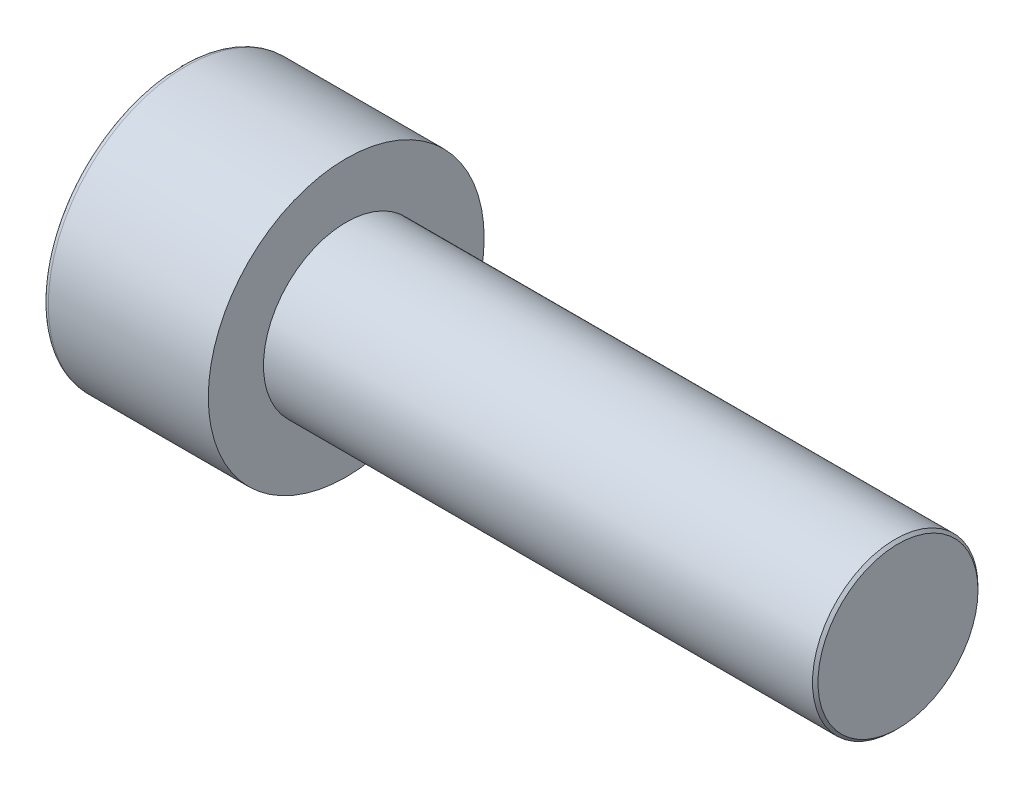
ISO-10303-21;
HEADER;
FILE_DESCRIPTION(('STEP AP214'),'2;1');
FILE_NAME('part.step','',(''),(''),'','','');
FILE_SCHEMA(('AUTOMOTIVE_DESIGN { 1 0 10303 214 1 1 1 1 }'));
ENDSEC;
DATA;
#1=APPLICATION_CONTEXT('core data for automotive mechanical design processes');
#2=APPLICATION_PROTOCOL_DEFINITION('international standard','automotive_design',2000,#1);
#3=PRODUCT_CONTEXT('',#1,'mechanical');
#4=PRODUCT('Part','Part','',(#3));
#5=PRODUCT_RELATED_PRODUCT_CATEGORY('part','',(#4));
#6=PRODUCT_DEFINITION_FORMATION('','',#4);
#7=PRODUCT_DEFINITION_CONTEXT('part definition',#1,'design');
#8=PRODUCT_DEFINITION('design','',#6,#7);
#9=PRODUCT_DEFINITION_SHAPE('','',#8);
#10=(LENGTH_UNIT() NAMED_UNIT(*) SI_UNIT(.MILLI.,.METRE.));
#11=(NAMED_UNIT(*) PLANE_ANGLE_UNIT() SI_UNIT($,.RADIAN.));
#12=(NAMED_UNIT(*) SI_UNIT($,.STERADIAN.) SOLID_ANGLE_UNIT());
#13=UNCERTAINTY_MEASURE_WITH_UNIT(LENGTH_MEASURE(1.E-05),#10,'distance_accuracy_value','');
#14=(GEOMETRIC_REPRESENTATION_CONTEXT(3) GLOBAL_UNCERTAINTY_ASSIGNED_CONTEXT((#13)) GLOBAL_UNIT_ASSIGNED_CONTEXT((#10,
#11,#12)) REPRESENTATION_CONTEXT('',''));
#15=CARTESIAN_POINT('',(0.,0.,0.));
#16=DIRECTION('',(0.,0.,1.));
#17=DIRECTION('',(1.,0.,0.));
#18=AXIS2_PLACEMENT_3D('',#15,#16,#17);
#19=CARTESIAN_POINT('',(3.,0.,-2.88675134594813));
#20=DIRECTION('',(1.,0.,0.));
#21=DIRECTION('',(0.,0.,-1.));
#22=AXIS2_PLACEMENT_3D('',#19,#20,#21);
#23=PLANE('',#22);
#24=CARTESIAN_POINT('',(3.,0.,0.));
#25=DIRECTION('',(1.,0.,0.));
#26=DIRECTION('',(0.,0.,-1.));
#27=AXIS2_PLACEMENT_3D('',#24,#25,#26);
#28=CIRCLE('',#27,2.5);
#29=CARTESIAN_POINT('',(3.,-1.25,-2.1650635094611));
#30=VERTEX_POINT('',#29);
#31=CARTESIAN_POINT('',(3.,-2.5,0.));
#32=VERTEX_POINT('',#31);
#33=EDGE_CURVE('E159',#30,#32,#28,.F.);
#34=ORIENTED_EDGE('',*,*,#33,.F.);
#35=DIRECTION('',(0.,0.866025403784439,-0.5));
#36=VECTOR('',#35,1.);
#37=CARTESIAN_POINT('',(3.,-2.5,-1.44337567297407));
#38=LINE('',#37,#36);
#39=CARTESIAN_POINT('',(3.,-2.5,-1.44337567297407));
#40=VERTEX_POINT('',#39);
#41=EDGE_CURVE('E167',#40,#30,#38,.T.);
#42=ORIENTED_EDGE('',*,*,#41,.F.);
#43=DIRECTION('',(0.,0.,-1.));
#44=VECTOR('',#43,1.);
#45=CARTESIAN_POINT('',(3.,-2.5,1.44337567297406));
#46=LINE('',#45,#44);
#47=EDGE_CURVE('E184',#32,#40,#46,.T.);
#48=ORIENTED_EDGE('',*,*,#47,.F.);
#49=EDGE_LOOP('',(#34,#42,#48));
#50=FACE_BOUND('',#49,.T.);
#51=ADVANCED_FACE('F36',(#50),#23,.F.);
#52=CARTESIAN_POINT('',(3.,-1.25,2.1650635094611));
#53=VERTEX_POINT('',#52);
#54=EDGE_CURVE('E289',#32,#53,#28,.F.);
#55=ORIENTED_EDGE('',*,*,#54,.F.);
#56=CARTESIAN_POINT('',(3.,-2.5,1.44337567297406));
#57=VERTEX_POINT('',#56);
#58=EDGE_CURVE('E185',#57,#32,#46,.T.);
#59=ORIENTED_EDGE('',*,*,#58,.F.);
#60=DIRECTION('',(0.,-0.866025403784439,-0.5));
#61=VECTOR('',#60,1.);
#62=CARTESIAN_POINT('',(3.,0.,2.88675134594813));
#63=LINE('',#62,#61);
#64=EDGE_CURVE('E180',#53,#57,#63,.T.);
#65=ORIENTED_EDGE('',*,*,#64,.F.);
#66=EDGE_LOOP('',(#55,#59,#65));
#67=FACE_BOUND('',#66,.T.);
#68=ADVANCED_FACE('F125',(#67),#23,.F.);
#69=CARTESIAN_POINT('',(3.,1.25,2.1650635094611));
#70=VERTEX_POINT('',#69);
#71=EDGE_CURVE('E285',#53,#70,#28,.F.);
#72=ORIENTED_EDGE('',*,*,#71,.F.);
#73=CARTESIAN_POINT('',(3.,0.,2.88675134594813));
#74=VERTEX_POINT('',#73);
#75=EDGE_CURVE('E181',#74,#53,#63,.T.);
#76=ORIENTED_EDGE('',*,*,#75,.F.);
#77=DIRECTION('',(0.,-0.866025403784439,0.5));
#78=VECTOR('',#77,1.);
#79=CARTESIAN_POINT('',(3.,2.5,1.44337567297406));
#80=LINE('',#79,#78);
#81=EDGE_CURVE('E176',#70,#74,#80,.T.);
#82=ORIENTED_EDGE('',*,*,#81,.F.);
#83=EDGE_LOOP('',(#72,#76,#82));
#84=FACE_BOUND('',#83,.T.);
#85=ADVANCED_FACE('F131',(#84),#23,.F.);
#86=CARTESIAN_POINT('',(3.,2.5,0.));
#87=VERTEX_POINT('',#86);
#88=EDGE_CURVE('E156',#70,#87,#28,.F.);
#89=ORIENTED_EDGE('',*,*,#88,.F.);
#90=CARTESIAN_POINT('',(3.,2.5,1.44337567297406));
#91=VERTEX_POINT('',#90);
#92=EDGE_CURVE('E177',#91,#70,#80,.T.);
#93=ORIENTED_EDGE('',*,*,#92,.F.);
#94=DIRECTION('',(0.,0.,1.));
#95=VECTOR('',#94,1.);
#96=CARTESIAN_POINT('',(3.,2.5,-1.44337567297406));
#97=LINE('',#96,#95);
#98=EDGE_CURVE('E171',#87,#91,#97,.T.);
#99=ORIENTED_EDGE('',*,*,#98,.F.);
#100=EDGE_LOOP('',(#89,#93,#99));
#101=FACE_BOUND('',#100,.T.);
#102=ADVANCED_FACE('F145',(#101),#23,.F.);
#103=CARTESIAN_POINT('',(3.,0.,0.));
#104=DIRECTION('',(1.,0.,0.));
#105=DIRECTION('',(0.,0.,-1.));
#106=AXIS2_PLACEMENT_3D('',#103,#104,#105);
#107=CIRCLE('',#106,2.5);
#108=CARTESIAN_POINT('',(3.,1.25,-2.1650635094611));
#109=VERTEX_POINT('',#108);
#110=EDGE_CURVE('E51',#109,#87,#107,.T.);
#111=ORIENTED_EDGE('',*,*,#110,.T.);
#112=CARTESIAN_POINT('',(3.,2.5,-1.44337567297406));
#113=VERTEX_POINT('',#112);
#114=EDGE_CURVE('E164',#113,#87,#97,.T.);
#115=ORIENTED_EDGE('',*,*,#114,.F.);
#116=DIRECTION('',(0.,0.866025403784438,0.5));
#117=VECTOR('',#116,1.);
#118=CARTESIAN_POINT('',(3.,0.,-2.88675134594813));
#119=LINE('',#118,#117);
#120=EDGE_CURVE('E161',#109,#113,#119,.T.);
#121=ORIENTED_EDGE('',*,*,#120,.F.);
#122=EDGE_LOOP('',(#111,#115,#121));
#123=FACE_BOUND('',#122,.T.);
#124=ADVANCED_FACE('F136',(#123),#23,.F.);
#125=EDGE_CURVE('E149',#109,#30,#28,.F.);
#126=ORIENTED_EDGE('',*,*,#125,.F.);
#127=CARTESIAN_POINT('',(3.,0.,-2.88675134594813));
#128=VERTEX_POINT('',#127);
#129=EDGE_CURVE('E152',#128,#109,#119,.T.);
#130=ORIENTED_EDGE('',*,*,#129,.F.);
#131=EDGE_CURVE('E154',#30,#128,#38,.T.);
#132=ORIENTED_EDGE('',*,*,#131,.F.);
#133=EDGE_LOOP('',(#126,#130,#132));
#134=FACE_BOUND('',#133,.T.);
#135=ADVANCED_FACE('F127',(#134),#23,.F.);
#136=CARTESIAN_POINT('',(0.,0.,0.));
#137=DIRECTION('',(1.,0.,0.));
#138=DIRECTION('',(0.,0.,-1.));
#139=AXIS2_PLACEMENT_3D('',#136,#137,#138);
#140=PLANE('',#139);
#141=CARTESIAN_POINT('',(0.,0.,0.));
#142=DIRECTION('',(1.,0.,0.));
#143=DIRECTION('',(0.,0.,-1.));
#144=AXIS2_PLACEMENT_3D('',#141,#142,#143);
#145=CIRCLE('',#144,4.8);
#146=CARTESIAN_POINT('',(0.,0.,-4.8));
#147=VERTEX_POINT('',#146);
#148=EDGE_CURVE('E224',#147,#147,#145,.F.);
#149=ORIENTED_EDGE('',*,*,#148,.T.);
#150=EDGE_LOOP('',(#149));
#151=FACE_BOUND('',#150,.T.);
#152=DIRECTION('',(0.,0.866025403784439,-0.5));
#153=VECTOR('',#152,1.);
#154=CARTESIAN_POINT('',(0.,-2.5,-1.44337567297407));
#155=LINE('',#154,#153);
#156=CARTESIAN_POINT('',(0.,-2.5,-1.44337567297407));
#157=VERTEX_POINT('',#156);
#158=CARTESIAN_POINT('',(0.,0.,-2.88675134594813));
#159=VERTEX_POINT('',#158);
#160=EDGE_CURVE('E59',#157,#159,#155,.T.);
#161=ORIENTED_EDGE('',*,*,#160,.T.);
#162=DIRECTION('',(0.,0.866025403784438,0.5));
#163=VECTOR('',#162,1.);
#164=CARTESIAN_POINT('',(0.,0.,-2.88675134594813));
#165=LINE('',#164,#163);
#166=CARTESIAN_POINT('',(0.,2.5,-1.44337567297406));
#167=VERTEX_POINT('',#166);
#168=EDGE_CURVE('E190',#159,#167,#165,.T.);
#169=ORIENTED_EDGE('',*,*,#168,.T.);
#170=DIRECTION('',(0.,0.,1.));
#171=VECTOR('',#170,1.);
#172=CARTESIAN_POINT('',(0.,2.5,-1.44337567297406));
#173=LINE('',#172,#171);
#174=CARTESIAN_POINT('',(0.,2.5,1.44337567297406));
#175=VERTEX_POINT('',#174);
#176=EDGE_CURVE('E193',#167,#175,#173,.T.);
#177=ORIENTED_EDGE('',*,*,#176,.T.);
#178=DIRECTION('',(0.,-0.866025403784439,0.5));
#179=VECTOR('',#178,1.);
#180=CARTESIAN_POINT('',(0.,2.5,1.44337567297406));
#181=LINE('',#180,#179);
#182=CARTESIAN_POINT('',(0.,0.,2.88675134594813));
#183=VERTEX_POINT('',#182);
#184=EDGE_CURVE('E196',#175,#183,#181,.T.);
#185=ORIENTED_EDGE('',*,*,#184,.T.);
#186=DIRECTION('',(0.,-0.866025403784439,-0.5));
#187=VECTOR('',#186,1.);
#188=CARTESIAN_POINT('',(0.,0.,2.88675134594813));
#189=LINE('',#188,#187);
#190=CARTESIAN_POINT('',(0.,-2.5,1.44337567297406));
#191=VERTEX_POINT('',#190);
#192=EDGE_CURVE('E199',#183,#191,#189,.T.);
#193=ORIENTED_EDGE('',*,*,#192,.T.);
#194=DIRECTION('',(0.,0.,-1.));
#195=VECTOR('',#194,1.);
#196=CARTESIAN_POINT('',(0.,-2.5,1.44337567297406));
#197=LINE('',#196,#195);
#198=EDGE_CURVE('E202',#191,#157,#197,.T.);
#199=ORIENTED_EDGE('',*,*,#198,.T.);
#200=EDGE_LOOP('',(#161,#169,#177,#185,#193,#199));
#201=FACE_BOUND('',#200,.T.);
#202=ADVANCED_FACE('F135',(#151,#201),#140,.F.);
#203=CARTESIAN_POINT('',(6.,0.,0.));
#204=DIRECTION('',(1.,0.,0.));
#205=DIRECTION('',(0.,0.,-1.));
#206=AXIS2_PLACEMENT_3D('',#203,#204,#205);
#207=PLANE('',#206);
#208=CARTESIAN_POINT('',(6.,0.,0.));
#209=DIRECTION('',(1.,0.,0.));
#210=DIRECTION('',(0.,0.,-1.));
#211=AXIS2_PLACEMENT_3D('',#208,#209,#210);
#212=CIRCLE('',#211,5.);
#213=CARTESIAN_POINT('',(6.,0.,-5.));
#214=VERTEX_POINT('',#213);
#215=EDGE_CURVE('E157',#214,#214,#212,.T.);
#216=ORIENTED_EDGE('',*,*,#215,.T.);
#217=EDGE_LOOP('',(#216));
#218=FACE_BOUND('',#217,.T.);
#219=CARTESIAN_POINT('',(6.,0.,0.));
#220=DIRECTION('',(1.,0.,0.));
#221=DIRECTION('',(0.,0.,-1.));
#222=AXIS2_PLACEMENT_3D('',#219,#220,#221);
#223=CIRCLE('',#222,3.);
#224=CARTESIAN_POINT('',(6.,0.,-3.));
#225=VERTEX_POINT('',#224);
#226=EDGE_CURVE('E215',#225,#225,#223,.T.);
#227=ORIENTED_EDGE('',*,*,#226,.F.);
#228=EDGE_LOOP('',(#227));
#229=FACE_BOUND('',#228,.T.);
#230=ADVANCED_FACE('F142',(#218,#229),#207,.T.);
#231=CARTESIAN_POINT('',(6.,0.,0.));
#232=DIRECTION('',(-1.,0.,0.));
#233=DIRECTION('',(0.,0.,1.));
#234=AXIS2_PLACEMENT_3D('',#231,#232,#233);
#235=CYLINDRICAL_SURFACE('',#234,5.);
#236=CARTESIAN_POINT('',(0.2,0.,0.));
#237=DIRECTION('',(1.,0.,0.));
#238=DIRECTION('',(0.,0.,-1.));
#239=AXIS2_PLACEMENT_3D('',#236,#237,#238);
#240=CIRCLE('',#239,5.);
#241=CARTESIAN_POINT('',(0.2,0.,-5.));
#242=VERTEX_POINT('',#241);
#243=EDGE_CURVE('E221',#242,#242,#240,.T.);
#244=ORIENTED_EDGE('',*,*,#243,.T.);
#245=EDGE_LOOP('',(#244));
#246=FACE_BOUND('',#245,.T.);
#247=ORIENTED_EDGE('',*,*,#215,.F.);
#248=EDGE_LOOP('',(#247));
#249=FACE_BOUND('',#248,.T.);
#250=ADVANCED_FACE('F240',(#246,#249),#235,.T.);
#251=CARTESIAN_POINT('',(26.,0.,0.));
#252=DIRECTION('',(-1.,0.,0.));
#253=DIRECTION('',(0.,0.,1.));
#254=AXIS2_PLACEMENT_3D('',#251,#252,#253);
#255=CYLINDRICAL_SURFACE('',#254,3.);
#256=CARTESIAN_POINT('',(25.9,0.,0.));
#257=DIRECTION('',(1.,0.,0.));
#258=DIRECTION('',(0.,0.,-1.));
#259=AXIS2_PLACEMENT_3D('',#256,#257,#258);
#260=CIRCLE('',#259,3.);
#261=CARTESIAN_POINT('',(25.9,0.,-3.));
#262=VERTEX_POINT('',#261);
#263=EDGE_CURVE('E11',#262,#262,#260,.F.);
#264=ORIENTED_EDGE('',*,*,#263,.T.);
#265=EDGE_LOOP('',(#264));
#266=FACE_BOUND('',#265,.T.);
#267=ORIENTED_EDGE('',*,*,#226,.T.);
#268=EDGE_LOOP('',(#267));
#269=FACE_BOUND('',#268,.T.);
#270=ADVANCED_FACE('F237',(#266,#269),#255,.T.);
#271=CARTESIAN_POINT('',(26.,0.,0.));
#272=DIRECTION('',(1.,0.,0.));
#273=DIRECTION('',(0.,0.,-1.));
#274=AXIS2_PLACEMENT_3D('',#271,#272,#273);
#275=PLANE('',#274);
#276=CARTESIAN_POINT('',(26.,0.,0.));
#277=DIRECTION('',(1.,0.,0.));
#278=DIRECTION('',(0.,0.,-1.));
#279=AXIS2_PLACEMENT_3D('',#276,#277,#278);
#280=CIRCLE('',#279,2.9);
#281=CARTESIAN_POINT('',(26.,0.,-2.9));
#282=VERTEX_POINT('',#281);
#283=EDGE_CURVE('E44',#282,#282,#280,.T.);
#284=ORIENTED_EDGE('',*,*,#283,.T.);
#285=EDGE_LOOP('',(#284));
#286=FACE_BOUND('',#285,.T.);
#287=ADVANCED_FACE('F229',(#286),#275,.T.);
#288=CARTESIAN_POINT('',(3.,-2.5,-1.44337567297407));
#289=DIRECTION('',(0.,0.5,0.866025403784439));
#290=DIRECTION('',(0.,-0.866025403784439,0.5));
#291=AXIS2_PLACEMENT_3D('',#288,#289,#290);
#292=PLANE('',#291);
#293=ORIENTED_EDGE('',*,*,#160,.F.);
#294=DIRECTION('',(-1.,0.,0.));
#295=VECTOR('',#294,1.);
#296=CARTESIAN_POINT('',(3.,-2.5,-1.44337567297407));
#297=LINE('',#296,#295);
#298=EDGE_CURVE('E188',#40,#157,#297,.T.);
#299=ORIENTED_EDGE('',*,*,#298,.F.);
#300=ORIENTED_EDGE('',*,*,#41,.T.);
#301=ORIENTED_EDGE('',*,*,#131,.T.);
#302=DIRECTION('',(-1.,0.,0.));
#303=VECTOR('',#302,1.);
#304=CARTESIAN_POINT('',(3.,0.,-2.88675134594813));
#305=LINE('',#304,#303);
#306=EDGE_CURVE('E170',#128,#159,#305,.T.);
#307=ORIENTED_EDGE('',*,*,#306,.T.);
#308=EDGE_LOOP('',(#293,#299,#300,#301,#307));
#309=FACE_BOUND('',#308,.T.);
#310=ADVANCED_FACE('F255',(#309),#292,.T.);
#311=CARTESIAN_POINT('',(3.,0.,-2.88675134594813));
#312=DIRECTION('',(0.,-0.5,0.866025403784438));
#313=DIRECTION('',(0.,-0.866025403784439,-0.5));
#314=AXIS2_PLACEMENT_3D('',#311,#312,#313);
#315=PLANE('',#314);
#316=ORIENTED_EDGE('',*,*,#168,.F.);
#317=ORIENTED_EDGE('',*,*,#306,.F.);
#318=ORIENTED_EDGE('',*,*,#129,.T.);
#319=ORIENTED_EDGE('',*,*,#120,.T.);
#320=DIRECTION('',(-1.,0.,0.));
#321=VECTOR('',#320,1.);
#322=CARTESIAN_POINT('',(3.,2.5,-1.44337567297406));
#323=LINE('',#322,#321);
#324=EDGE_CURVE('E212',#113,#167,#323,.T.);
#325=ORIENTED_EDGE('',*,*,#324,.T.);
#326=EDGE_LOOP('',(#316,#317,#318,#319,#325));
#327=FACE_BOUND('',#326,.T.);
#328=ADVANCED_FACE('F169',(#327),#315,.T.);
#329=CARTESIAN_POINT('',(3.,2.5,-1.44337567297406));
#330=DIRECTION('',(0.,-1.,0.));
#331=DIRECTION('',(0.,0.,-1.));
#332=AXIS2_PLACEMENT_3D('',#329,#330,#331);
#333=PLANE('',#332);
#334=ORIENTED_EDGE('',*,*,#176,.F.);
#335=ORIENTED_EDGE('',*,*,#324,.F.);
#336=ORIENTED_EDGE('',*,*,#114,.T.);
#337=ORIENTED_EDGE('',*,*,#98,.T.);
#338=DIRECTION('',(-1.,0.,0.));
#339=VECTOR('',#338,1.);
#340=CARTESIAN_POINT('',(3.,2.5,1.44337567297406));
#341=LINE('',#340,#339);
#342=EDGE_CURVE('E210',#91,#175,#341,.T.);
#343=ORIENTED_EDGE('',*,*,#342,.T.);
#344=EDGE_LOOP('',(#334,#335,#336,#337,#343));
#345=FACE_BOUND('',#344,.T.);
#346=ADVANCED_FACE('F260',(#345),#333,.T.);
#347=CARTESIAN_POINT('',(3.,2.5,1.44337567297406));
#348=DIRECTION('',(0.,-0.5,-0.866025403784439));
#349=DIRECTION('',(0.,0.866025403784439,-0.5));
#350=AXIS2_PLACEMENT_3D('',#347,#348,#349);
#351=PLANE('',#350);
#352=ORIENTED_EDGE('',*,*,#184,.F.);
#353=ORIENTED_EDGE('',*,*,#342,.F.);
#354=ORIENTED_EDGE('',*,*,#92,.T.);
#355=ORIENTED_EDGE('',*,*,#81,.T.);
#356=DIRECTION('',(-1.,0.,0.));
#357=VECTOR('',#356,1.);
#358=CARTESIAN_POINT('',(3.,0.,2.88675134594813));
#359=LINE('',#358,#357);
#360=EDGE_CURVE('E208',#74,#183,#359,.T.);
#361=ORIENTED_EDGE('',*,*,#360,.T.);
#362=EDGE_LOOP('',(#352,#353,#354,#355,#361));
#363=FACE_BOUND('',#362,.T.);
#364=ADVANCED_FACE('F263',(#363),#351,.T.);
#365=CARTESIAN_POINT('',(3.,0.,2.88675134594813));
#366=DIRECTION('',(0.,0.5,-0.866025403784438));
#367=DIRECTION('',(0.,0.866025403784439,0.5));
#368=AXIS2_PLACEMENT_3D('',#365,#366,#367);
#369=PLANE('',#368);
#370=ORIENTED_EDGE('',*,*,#192,.F.);
#371=ORIENTED_EDGE('',*,*,#360,.F.);
#372=ORIENTED_EDGE('',*,*,#75,.T.);
#373=ORIENTED_EDGE('',*,*,#64,.T.);
#374=DIRECTION('',(-1.,0.,0.));
#375=VECTOR('',#374,1.);
#376=CARTESIAN_POINT('',(3.,-2.5,1.44337567297406));
#377=LINE('',#376,#375);
#378=EDGE_CURVE('E206',#57,#191,#377,.T.);
#379=ORIENTED_EDGE('',*,*,#378,.T.);
#380=EDGE_LOOP('',(#370,#371,#372,#373,#379));
#381=FACE_BOUND('',#380,.T.);
#382=ADVANCED_FACE('F120',(#381),#369,.T.);
#383=CARTESIAN_POINT('',(3.,-2.5,1.44337567297406));
#384=DIRECTION('',(0.,1.,0.));
#385=DIRECTION('',(0.,0.,1.));
#386=AXIS2_PLACEMENT_3D('',#383,#384,#385);
#387=PLANE('',#386);
#388=ORIENTED_EDGE('',*,*,#198,.F.);
#389=ORIENTED_EDGE('',*,*,#378,.F.);
#390=ORIENTED_EDGE('',*,*,#58,.T.);
#391=ORIENTED_EDGE('',*,*,#47,.T.);
#392=ORIENTED_EDGE('',*,*,#298,.T.);
#393=EDGE_LOOP('',(#388,#389,#390,#391,#392));
#394=FACE_BOUND('',#393,.T.);
#395=ADVANCED_FACE('F113',(#394),#387,.T.);
#396=CARTESIAN_POINT('',(3.,0.,0.));
#397=DIRECTION('',(-1.,0.,0.));
#398=DIRECTION('',(0.,0.,1.));
#399=AXIS2_PLACEMENT_3D('',#396,#397,#398);
#400=CONICAL_SURFACE('',#399,2.5,1.04719755119659);
#401=CARTESIAN_POINT('',(4.44337567297408,0.,0.));
#402=VERTEX_POINT('',#401);
#403=VERTEX_LOOP('',#402);
#404=FACE_BOUND('',#403,.T.);
#405=ORIENTED_EDGE('',*,*,#110,.F.);
#406=ORIENTED_EDGE('',*,*,#125,.T.);
#407=ORIENTED_EDGE('',*,*,#33,.T.);
#408=ORIENTED_EDGE('',*,*,#54,.T.);
#409=ORIENTED_EDGE('',*,*,#71,.T.);
#410=ORIENTED_EDGE('',*,*,#88,.T.);
#411=EDGE_LOOP('',(#405,#406,#407,#408,#409,#410));
#412=FACE_BOUND('',#411,.T.);
#413=ADVANCED_FACE('F110',(#404,#412),#400,.F.);
#414=CARTESIAN_POINT('',(0.2,0.,0.));
#415=DIRECTION('',(1.,0.,0.));
#416=DIRECTION('',(0.,0.,-1.));
#417=AXIS2_PLACEMENT_3D('',#414,#415,#416);
#418=TOROIDAL_SURFACE('',#417,4.8,0.2);
#419=ORIENTED_EDGE('',*,*,#148,.F.);
#420=EDGE_LOOP('',(#419));
#421=FACE_BOUND('',#420,.T.);
#422=ORIENTED_EDGE('',*,*,#243,.F.);
#423=EDGE_LOOP('',(#422));
#424=FACE_BOUND('',#423,.T.);
#425=ADVANCED_FACE('F112',(#421,#424),#418,.T.);
#426=CARTESIAN_POINT('',(26.,0.,0.));
#427=DIRECTION('',(-1.,0.,0.));
#428=DIRECTION('',(0.,0.,1.));
#429=AXIS2_PLACEMENT_3D('',#426,#427,#428);
#430=CONICAL_SURFACE('',#429,2.9,0.785398163397455);
#431=ORIENTED_EDGE('',*,*,#263,.F.);
#432=EDGE_LOOP('',(#431));
#433=FACE_BOUND('',#432,.T.);
#434=ORIENTED_EDGE('',*,*,#283,.F.);
#435=EDGE_LOOP('',(#434));
#436=FACE_BOUND('',#435,.T.);
#437=ADVANCED_FACE('F38',(#433,#436),#430,.T.);
#438=CLOSED_SHELL('',(#51,#68,#85,#102,#124,#135,#202,#230,#250,#270,#287,#310,#328,#346,#364,
#382,#395,#413,#425,#437));
#439=MANIFOLD_SOLID_BREP('B2',#438);
#440=ADVANCED_BREP_SHAPE_REPRESENTATION('',(#18,#439),#14);
#441=SHAPE_DEFINITION_REPRESENTATION(#9,#440);
ENDSEC;
END-ISO-10303-21;
